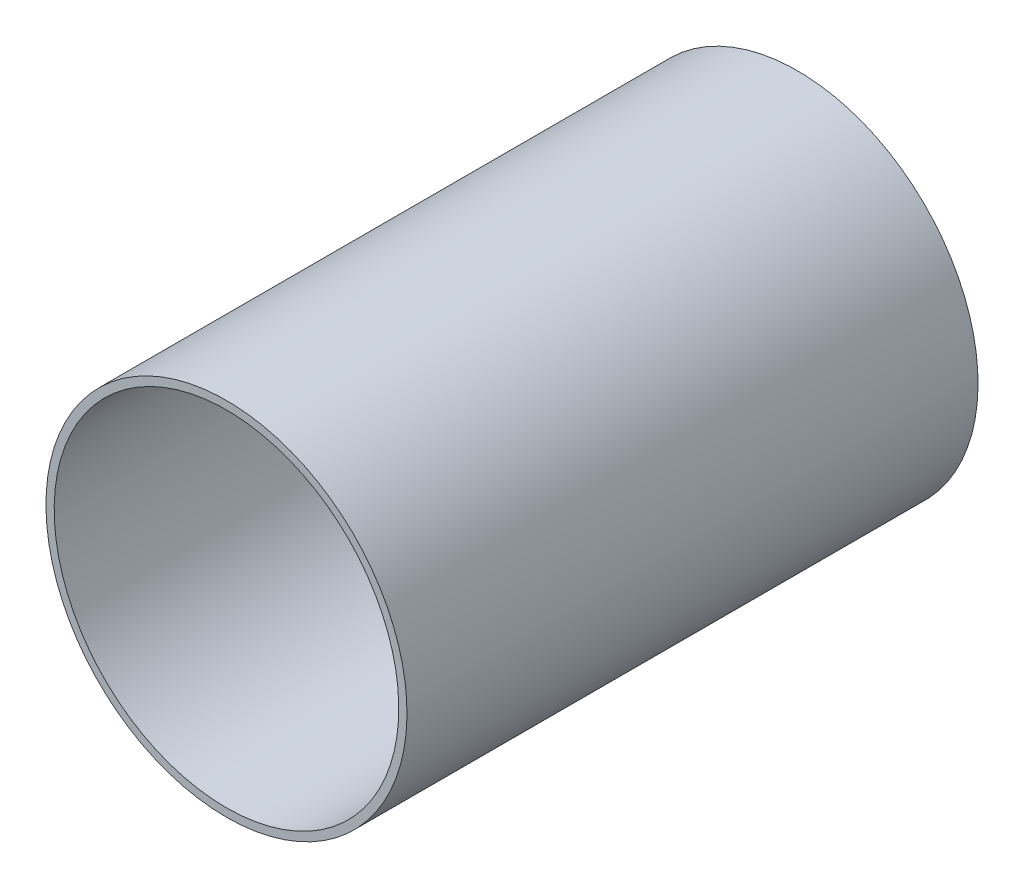
ISO-10303-21;
HEADER;
FILE_DESCRIPTION(('STEP AP214'),'2;1');
FILE_NAME('part.step','',(''),(''),'','','');
FILE_SCHEMA(('AUTOMOTIVE_DESIGN { 1 0 10303 214 1 1 1 1 }'));
ENDSEC;
DATA;
#1=APPLICATION_CONTEXT('core data for automotive mechanical design processes');
#2=APPLICATION_PROTOCOL_DEFINITION('international standard','automotive_design',2000,#1);
#3=PRODUCT_CONTEXT('',#1,'mechanical');
#4=PRODUCT('Part','Part','',(#3));
#5=PRODUCT_RELATED_PRODUCT_CATEGORY('part','',(#4));
#6=PRODUCT_DEFINITION_FORMATION('','',#4);
#7=PRODUCT_DEFINITION_CONTEXT('part definition',#1,'design');
#8=PRODUCT_DEFINITION('design','',#6,#7);
#9=PRODUCT_DEFINITION_SHAPE('','',#8);
#10=(LENGTH_UNIT() NAMED_UNIT(*) SI_UNIT(.MILLI.,.METRE.));
#11=(NAMED_UNIT(*) PLANE_ANGLE_UNIT() SI_UNIT($,.RADIAN.));
#12=(NAMED_UNIT(*) SI_UNIT($,.STERADIAN.) SOLID_ANGLE_UNIT());
#13=UNCERTAINTY_MEASURE_WITH_UNIT(LENGTH_MEASURE(1.E-05),#10,'distance_accuracy_value','');
#14=(GEOMETRIC_REPRESENTATION_CONTEXT(3) GLOBAL_UNCERTAINTY_ASSIGNED_CONTEXT((#13)) GLOBAL_UNIT_ASSIGNED_CONTEXT((#10,
#11,#12)) REPRESENTATION_CONTEXT('',''));
#15=CARTESIAN_POINT('',(0.,0.,0.));
#16=DIRECTION('',(0.,0.,1.));
#17=DIRECTION('',(1.,0.,0.));
#18=AXIS2_PLACEMENT_3D('',#15,#16,#17);
#19=CARTESIAN_POINT('',(126.802,-111.684,-0.045));
#20=DIRECTION('',(0.,0.,-1.));
#21=DIRECTION('',(0.,-1.,0.));
#22=AXIS2_PLACEMENT_3D('',#19,#20,#21);
#23=CYLINDRICAL_SURFACE('',#22,0.525);
#24=CARTESIAN_POINT('',(126.802,-111.684,-0.035));
#25=DIRECTION('',(0.,0.,-1.));
#26=DIRECTION('',(0.,-1.,0.));
#27=AXIS2_PLACEMENT_3D('',#24,#25,#26);
#28=CIRCLE('',#27,0.525);
#29=CARTESIAN_POINT('',(126.802,-112.209,-0.035));
#30=VERTEX_POINT('',#29);
#31=EDGE_CURVE('E53',#30,#30,#28,.T.);
#32=ORIENTED_EDGE('',*,*,#31,.T.);
#33=DIRECTION('',(0.,0.,1.));
#34=VECTOR('',#33,1.);
#35=CARTESIAN_POINT('',(126.802,-112.209,-0.045));
#36=LINE('',#35,#34);
#37=CARTESIAN_POINT('',(126.802,-112.209,1.705));
#38=VERTEX_POINT('',#37);
#39=EDGE_CURVE('E11',#30,#38,#36,.T.);
#40=ORIENTED_EDGE('',*,*,#39,.T.);
#41=CARTESIAN_POINT('',(126.802,-111.684,1.705));
#42=DIRECTION('',(0.,0.,-1.));
#43=DIRECTION('',(0.,-1.,0.));
#44=AXIS2_PLACEMENT_3D('',#41,#42,#43);
#45=CIRCLE('',#44,0.525);
#46=EDGE_CURVE('E26',#38,#38,#45,.T.);
#47=ORIENTED_EDGE('',*,*,#46,.F.);
#48=ORIENTED_EDGE('',*,*,#39,.F.);
#49=EDGE_LOOP('',(#32,#40,#47,#48));
#50=FACE_BOUND('',#49,.T.);
#51=ADVANCED_FACE('F17',(#50),#23,.F.);
#52=CARTESIAN_POINT('',(126.802,-112.234,1.705));
#53=DIRECTION('',(0.,0.,1.));
#54=DIRECTION('',(1.,0.,0.));
#55=AXIS2_PLACEMENT_3D('',#52,#53,#54);
#56=PLANE('',#55);
#57=ORIENTED_EDGE('',*,*,#46,.T.);
#58=EDGE_LOOP('',(#57));
#59=FACE_BOUND('',#58,.T.);
#60=CARTESIAN_POINT('',(126.802,-111.684,1.705));
#61=DIRECTION('',(0.,0.,1.));
#62=DIRECTION('',(0.,-1.,0.));
#63=AXIS2_PLACEMENT_3D('',#60,#61,#62);
#64=CIRCLE('',#63,0.55);
#65=CARTESIAN_POINT('',(126.802,-112.234,1.705));
#66=VERTEX_POINT('',#65);
#67=EDGE_CURVE('E48',#66,#66,#64,.T.);
#68=ORIENTED_EDGE('',*,*,#67,.T.);
#69=EDGE_LOOP('',(#68));
#70=FACE_BOUND('',#69,.T.);
#71=ADVANCED_FACE('F49',(#59,#70),#56,.T.);
#72=CARTESIAN_POINT('',(126.802,-112.234,-0.035));
#73=DIRECTION('',(0.,0.,1.));
#74=DIRECTION('',(1.,0.,0.));
#75=AXIS2_PLACEMENT_3D('',#72,#73,#74);
#76=PLANE('',#75);
#77=ORIENTED_EDGE('',*,*,#31,.F.);
#78=EDGE_LOOP('',(#77));
#79=FACE_BOUND('',#78,.T.);
#80=CARTESIAN_POINT('',(126.802,-111.684,-0.035));
#81=DIRECTION('',(0.,0.,1.));
#82=DIRECTION('',(0.,-1.,0.));
#83=AXIS2_PLACEMENT_3D('',#80,#81,#82);
#84=CIRCLE('',#83,0.55);
#85=CARTESIAN_POINT('',(126.802,-112.234,-0.035));
#86=VERTEX_POINT('',#85);
#87=EDGE_CURVE('E62',#86,#86,#84,.T.);
#88=ORIENTED_EDGE('',*,*,#87,.F.);
#89=EDGE_LOOP('',(#88));
#90=FACE_BOUND('',#89,.T.);
#91=ADVANCED_FACE('F71',(#79,#90),#76,.F.);
#92=CARTESIAN_POINT('',(126.802,-111.684,-0.035));
#93=DIRECTION('',(0.,0.,-1.));
#94=DIRECTION('',(0.,-1.,0.));
#95=AXIS2_PLACEMENT_3D('',#92,#93,#94);
#96=CYLINDRICAL_SURFACE('',#95,0.55);
#97=ORIENTED_EDGE('',*,*,#87,.T.);
#98=DIRECTION('',(0.,0.,1.));
#99=VECTOR('',#98,1.);
#100=CARTESIAN_POINT('',(126.802,-112.234,-0.035));
#101=LINE('',#100,#99);
#102=EDGE_CURVE('E54',#86,#66,#101,.T.);
#103=ORIENTED_EDGE('',*,*,#102,.T.);
#104=ORIENTED_EDGE('',*,*,#67,.F.);
#105=ORIENTED_EDGE('',*,*,#102,.F.);
#106=EDGE_LOOP('',(#97,#103,#104,#105));
#107=FACE_BOUND('',#106,.T.);
#108=ADVANCED_FACE('F74',(#107),#96,.T.);
#109=CLOSED_SHELL('',(#51,#71,#91,#108));
#110=MANIFOLD_SOLID_BREP('B1',#109);
#111=ADVANCED_BREP_SHAPE_REPRESENTATION('',(#18,#110),#14);
#112=SHAPE_DEFINITION_REPRESENTATION(#9,#111);
ENDSEC;
END-ISO-10303-21;
